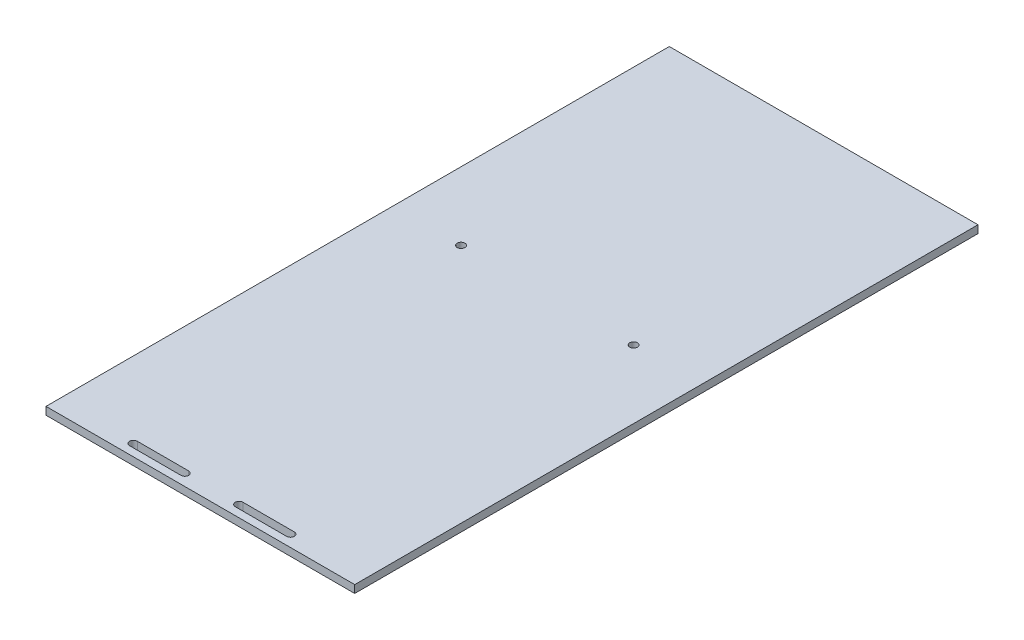
ISO-10303-21;
HEADER;
FILE_DESCRIPTION(('STEP AP214'),'2;1');
FILE_NAME('part.step','',(''),(''),'','','');
FILE_SCHEMA(('AUTOMOTIVE_DESIGN { 1 0 10303 214 1 1 1 1 }'));
ENDSEC;
DATA;
#1=APPLICATION_CONTEXT('core data for automotive mechanical design processes');
#2=APPLICATION_PROTOCOL_DEFINITION('international standard','automotive_design',2000,#1);
#3=PRODUCT_CONTEXT('',#1,'mechanical');
#4=PRODUCT('Part','Part','',(#3));
#5=PRODUCT_RELATED_PRODUCT_CATEGORY('part','',(#4));
#6=PRODUCT_DEFINITION_FORMATION('','',#4);
#7=PRODUCT_DEFINITION_CONTEXT('part definition',#1,'design');
#8=PRODUCT_DEFINITION('design','',#6,#7);
#9=PRODUCT_DEFINITION_SHAPE('','',#8);
#10=(LENGTH_UNIT() NAMED_UNIT(*) SI_UNIT(.MILLI.,.METRE.));
#11=(NAMED_UNIT(*) PLANE_ANGLE_UNIT() SI_UNIT($,.RADIAN.));
#12=(NAMED_UNIT(*) SI_UNIT($,.STERADIAN.) SOLID_ANGLE_UNIT());
#13=UNCERTAINTY_MEASURE_WITH_UNIT(LENGTH_MEASURE(1.E-05),#10,'distance_accuracy_value','');
#14=(GEOMETRIC_REPRESENTATION_CONTEXT(3) GLOBAL_UNCERTAINTY_ASSIGNED_CONTEXT((#13)) GLOBAL_UNIT_ASSIGNED_CONTEXT((#10,
#11,#12)) REPRESENTATION_CONTEXT('',''));
#15=CARTESIAN_POINT('',(0.,0.,0.));
#16=DIRECTION('',(0.,0.,1.));
#17=DIRECTION('',(1.,0.,0.));
#18=AXIS2_PLACEMENT_3D('',#15,#16,#17);
#19=CARTESIAN_POINT('',(0.,3.,0.));
#20=DIRECTION('',(0.,0.,-1.));
#21=DIRECTION('',(-1.,0.,0.));
#22=AXIS2_PLACEMENT_3D('',#19,#20,#21);
#23=PLANE('',#22);
#24=DIRECTION('',(1.,0.,0.));
#25=VECTOR('',#24,1.);
#26=CARTESIAN_POINT('',(0.,0.,0.));
#27=LINE('',#26,#25);
#28=CARTESIAN_POINT('',(0.,0.,0.));
#29=VERTEX_POINT('',#28);
#30=CARTESIAN_POINT('',(120.112060779303,0.,0.));
#31=VERTEX_POINT('',#30);
#32=EDGE_CURVE('E225',#29,#31,#27,.T.);
#33=ORIENTED_EDGE('',*,*,#32,.F.);
#34=DIRECTION('',(0.,-1.,0.));
#35=VECTOR('',#34,1.);
#36=CARTESIAN_POINT('',(0.,3.,0.));
#37=LINE('',#36,#35);
#38=CARTESIAN_POINT('',(0.,3.,0.));
#39=VERTEX_POINT('',#38);
#40=EDGE_CURVE('E11',#39,#29,#37,.T.);
#41=ORIENTED_EDGE('',*,*,#40,.F.);
#42=DIRECTION('',(1.,0.,0.));
#43=VECTOR('',#42,1.);
#44=CARTESIAN_POINT('',(0.,3.,0.));
#45=LINE('',#44,#43);
#46=CARTESIAN_POINT('',(120.112060779303,3.,0.));
#47=VERTEX_POINT('',#46);
#48=EDGE_CURVE('E234',#39,#47,#45,.T.);
#49=ORIENTED_EDGE('',*,*,#48,.T.);
#50=DIRECTION('',(0.,-1.,0.));
#51=VECTOR('',#50,1.);
#52=CARTESIAN_POINT('',(120.112060779303,3.,0.));
#53=LINE('',#52,#51);
#54=EDGE_CURVE('E41',#47,#31,#53,.T.);
#55=ORIENTED_EDGE('',*,*,#54,.T.);
#56=EDGE_LOOP('',(#33,#41,#49,#55));
#57=FACE_BOUND('',#56,.T.);
#58=ADVANCED_FACE('F38',(#57),#23,.T.);
#59=CARTESIAN_POINT('',(0.,3.,0.));
#60=DIRECTION('',(1.,0.,0.));
#61=DIRECTION('',(0.,0.,-1.));
#62=AXIS2_PLACEMENT_3D('',#59,#60,#61);
#63=PLANE('',#62);
#64=DIRECTION('',(0.,0.,1.));
#65=VECTOR('',#64,1.);
#66=CARTESIAN_POINT('',(0.,0.,0.));
#67=LINE('',#66,#65);
#68=CARTESIAN_POINT('',(0.,0.,242.505963566266));
#69=VERTEX_POINT('',#68);
#70=EDGE_CURVE('E239',#29,#69,#67,.T.);
#71=ORIENTED_EDGE('',*,*,#70,.T.);
#72=DIRECTION('',(0.,-1.,0.));
#73=VECTOR('',#72,1.);
#74=CARTESIAN_POINT('',(0.,3.,242.505963566266));
#75=LINE('',#74,#73);
#76=CARTESIAN_POINT('',(0.,3.,242.505963566266));
#77=VERTEX_POINT('',#76);
#78=EDGE_CURVE('E47',#77,#69,#75,.T.);
#79=ORIENTED_EDGE('',*,*,#78,.F.);
#80=DIRECTION('',(0.,0.,1.));
#81=VECTOR('',#80,1.);
#82=CARTESIAN_POINT('',(0.,3.,0.));
#83=LINE('',#82,#81);
#84=EDGE_CURVE('E246',#39,#77,#83,.T.);
#85=ORIENTED_EDGE('',*,*,#84,.F.);
#86=ORIENTED_EDGE('',*,*,#40,.T.);
#87=EDGE_LOOP('',(#71,#79,#85,#86));
#88=FACE_BOUND('',#87,.T.);
#89=ADVANCED_FACE('F280',(#88),#63,.F.);
#90=CARTESIAN_POINT('',(0.,3.,242.505963566266));
#91=DIRECTION('',(0.,0.,-1.));
#92=DIRECTION('',(-1.,0.,0.));
#93=AXIS2_PLACEMENT_3D('',#90,#91,#92);
#94=PLANE('',#93);
#95=DIRECTION('',(1.,0.,0.));
#96=VECTOR('',#95,1.);
#97=CARTESIAN_POINT('',(0.,0.,242.505963566266));
#98=LINE('',#97,#96);
#99=CARTESIAN_POINT('',(120.112060779303,0.,242.505963566266));
#100=VERTEX_POINT('',#99);
#101=EDGE_CURVE('E256',#69,#100,#98,.T.);
#102=ORIENTED_EDGE('',*,*,#101,.T.);
#103=DIRECTION('',(0.,-1.,0.));
#104=VECTOR('',#103,1.);
#105=CARTESIAN_POINT('',(120.112060779303,3.,242.505963566266));
#106=LINE('',#105,#104);
#107=CARTESIAN_POINT('',(120.112060779303,3.,242.505963566266));
#108=VERTEX_POINT('',#107);
#109=EDGE_CURVE('E264',#108,#100,#106,.T.);
#110=ORIENTED_EDGE('',*,*,#109,.F.);
#111=DIRECTION('',(1.,0.,0.));
#112=VECTOR('',#111,1.);
#113=CARTESIAN_POINT('',(0.,3.,242.505963566266));
#114=LINE('',#113,#112);
#115=EDGE_CURVE('E243',#77,#108,#114,.T.);
#116=ORIENTED_EDGE('',*,*,#115,.F.);
#117=ORIENTED_EDGE('',*,*,#78,.T.);
#118=EDGE_LOOP('',(#102,#110,#116,#117));
#119=FACE_BOUND('',#118,.T.);
#120=ADVANCED_FACE('F284',(#119),#94,.F.);
#121=CARTESIAN_POINT('',(120.112060779303,3.,0.));
#122=DIRECTION('',(1.,0.,0.));
#123=DIRECTION('',(0.,0.,-1.));
#124=AXIS2_PLACEMENT_3D('',#121,#122,#123);
#125=PLANE('',#124);
#126=DIRECTION('',(0.,0.,1.));
#127=VECTOR('',#126,1.);
#128=CARTESIAN_POINT('',(120.112060779303,0.,0.));
#129=LINE('',#128,#127);
#130=EDGE_CURVE('E252',#31,#100,#129,.T.);
#131=ORIENTED_EDGE('',*,*,#130,.F.);
#132=ORIENTED_EDGE('',*,*,#54,.F.);
#133=DIRECTION('',(0.,0.,1.));
#134=VECTOR('',#133,1.);
#135=CARTESIAN_POINT('',(120.112060779303,3.,0.));
#136=LINE('',#135,#134);
#137=EDGE_CURVE('E238',#47,#108,#136,.T.);
#138=ORIENTED_EDGE('',*,*,#137,.T.);
#139=ORIENTED_EDGE('',*,*,#109,.T.);
#140=EDGE_LOOP('',(#131,#132,#138,#139));
#141=FACE_BOUND('',#140,.T.);
#142=ADVANCED_FACE('F274',(#141),#125,.T.);
#143=CARTESIAN_POINT('',(0.,3.,0.));
#144=DIRECTION('',(0.,-1.,0.));
#145=DIRECTION('',(0.,0.,-1.));
#146=AXIS2_PLACEMENT_3D('',#143,#144,#145);
#147=PLANE('',#146);
#148=DIRECTION('',(1.,0.,0.));
#149=VECTOR('',#148,1.);
#150=CARTESIAN_POINT('',(70.6120607793027,3.,239.5));
#151=LINE('',#150,#149);
#152=CARTESIAN_POINT('',(70.6120607793027,3.,239.5));
#153=VERTEX_POINT('',#152);
#154=CARTESIAN_POINT('',(90.6120607793027,3.,239.5));
#155=VERTEX_POINT('',#154);
#156=EDGE_CURVE('E168',#153,#155,#151,.T.);
#157=ORIENTED_EDGE('',*,*,#156,.F.);
#158=CARTESIAN_POINT('',(70.6120607793027,3.,238.));
#159=DIRECTION('',(0.,1.,0.));
#160=DIRECTION('',(0.,0.,1.));
#161=AXIS2_PLACEMENT_3D('',#158,#159,#160);
#162=CIRCLE('',#161,1.5);
#163=CARTESIAN_POINT('',(70.6120607793027,3.,236.5));
#164=VERTEX_POINT('',#163);
#165=EDGE_CURVE('E55',#164,#153,#162,.T.);
#166=ORIENTED_EDGE('',*,*,#165,.F.);
#167=DIRECTION('',(-1.,0.,0.));
#168=VECTOR('',#167,1.);
#169=CARTESIAN_POINT('',(70.6120607793027,3.,236.5));
#170=LINE('',#169,#168);
#171=CARTESIAN_POINT('',(90.6120607793027,3.,236.5));
#172=VERTEX_POINT('',#171);
#173=EDGE_CURVE('E152',#172,#164,#170,.T.);
#174=ORIENTED_EDGE('',*,*,#173,.F.);
#175=CARTESIAN_POINT('',(90.6120607793027,3.,238.));
#176=DIRECTION('',(0.,1.,0.));
#177=DIRECTION('',(0.,0.,1.));
#178=AXIS2_PLACEMENT_3D('',#175,#176,#177);
#179=CIRCLE('',#178,1.5);
#180=EDGE_CURVE('E156',#155,#172,#179,.T.);
#181=ORIENTED_EDGE('',*,*,#180,.F.);
#182=EDGE_LOOP('',(#157,#166,#174,#181));
#183=FACE_BOUND('',#182,.T.);
#184=CARTESIAN_POINT('',(26.5,3.,107.505963566266));
#185=DIRECTION('',(0.,1.,0.));
#186=DIRECTION('',(0.,0.,1.));
#187=AXIS2_PLACEMENT_3D('',#184,#185,#186);
#188=CIRCLE('',#187,1.5);
#189=CARTESIAN_POINT('',(26.5,3.,109.005963566266));
#190=VERTEX_POINT('',#189);
#191=EDGE_CURVE('E186',#190,#190,#188,.T.);
#192=ORIENTED_EDGE('',*,*,#191,.F.);
#193=EDGE_LOOP('',(#192));
#194=FACE_BOUND('',#193,.T.);
#195=CARTESIAN_POINT('',(93.6120607793027,3.,107.505963566266));
#196=DIRECTION('',(0.,1.,0.));
#197=DIRECTION('',(0.,0.,1.));
#198=AXIS2_PLACEMENT_3D('',#195,#196,#197);
#199=CIRCLE('',#198,1.5);
#200=CARTESIAN_POINT('',(93.6120607793027,3.,109.005963566266));
#201=VERTEX_POINT('',#200);
#202=EDGE_CURVE('E159',#201,#201,#199,.T.);
#203=ORIENTED_EDGE('',*,*,#202,.F.);
#204=EDGE_LOOP('',(#203));
#205=FACE_BOUND('',#204,.T.);
#206=DIRECTION('',(1.,0.,0.));
#207=VECTOR('',#206,1.);
#208=CARTESIAN_POINT('',(29.5,3.,239.5));
#209=LINE('',#208,#207);
#210=CARTESIAN_POINT('',(29.5,3.,239.5));
#211=VERTEX_POINT('',#210);
#212=CARTESIAN_POINT('',(49.5,3.,239.5));
#213=VERTEX_POINT('',#212);
#214=EDGE_CURVE('E211',#211,#213,#209,.T.);
#215=ORIENTED_EDGE('',*,*,#214,.F.);
#216=CARTESIAN_POINT('',(29.5,3.,238.));
#217=DIRECTION('',(0.,1.,0.));
#218=DIRECTION('',(0.,0.,1.));
#219=AXIS2_PLACEMENT_3D('',#216,#217,#218);
#220=CIRCLE('',#219,1.5);
#221=CARTESIAN_POINT('',(29.5,3.,236.5));
#222=VERTEX_POINT('',#221);
#223=EDGE_CURVE('E63',#222,#211,#220,.T.);
#224=ORIENTED_EDGE('',*,*,#223,.F.);
#225=DIRECTION('',(-1.,0.,0.));
#226=VECTOR('',#225,1.);
#227=CARTESIAN_POINT('',(29.5,3.,236.5));
#228=LINE('',#227,#226);
#229=CARTESIAN_POINT('',(49.5,3.,236.5));
#230=VERTEX_POINT('',#229);
#231=EDGE_CURVE('E196',#230,#222,#228,.T.);
#232=ORIENTED_EDGE('',*,*,#231,.F.);
#233=CARTESIAN_POINT('',(49.5,3.,238.));
#234=DIRECTION('',(0.,1.,0.));
#235=DIRECTION('',(0.,0.,1.));
#236=AXIS2_PLACEMENT_3D('',#233,#234,#235);
#237=CIRCLE('',#236,1.5);
#238=EDGE_CURVE('E215',#213,#230,#237,.T.);
#239=ORIENTED_EDGE('',*,*,#238,.F.);
#240=EDGE_LOOP('',(#215,#224,#232,#239));
#241=FACE_BOUND('',#240,.T.);
#242=ORIENTED_EDGE('',*,*,#48,.F.);
#243=ORIENTED_EDGE('',*,*,#84,.T.);
#244=ORIENTED_EDGE('',*,*,#115,.T.);
#245=ORIENTED_EDGE('',*,*,#137,.F.);
#246=EDGE_LOOP('',(#242,#243,#244,#245));
#247=FACE_BOUND('',#246,.T.);
#248=ADVANCED_FACE('F286',(#183,#194,#205,#241,#247),#147,.F.);
#249=CARTESIAN_POINT('',(0.,0.,0.));
#250=DIRECTION('',(0.,-1.,0.));
#251=DIRECTION('',(0.,0.,-1.));
#252=AXIS2_PLACEMENT_3D('',#249,#250,#251);
#253=PLANE('',#252);
#254=CARTESIAN_POINT('',(70.6120607793027,0.,238.));
#255=DIRECTION('',(0.,1.,0.));
#256=DIRECTION('',(0.,0.,1.));
#257=AXIS2_PLACEMENT_3D('',#254,#255,#256);
#258=CIRCLE('',#257,1.5);
#259=CARTESIAN_POINT('',(70.6120607793027,0.,236.5));
#260=VERTEX_POINT('',#259);
#261=CARTESIAN_POINT('',(70.6120607793027,0.,239.5));
#262=VERTEX_POINT('',#261);
#263=EDGE_CURVE('E130',#260,#262,#258,.T.);
#264=ORIENTED_EDGE('',*,*,#263,.T.);
#265=DIRECTION('',(1.,0.,0.));
#266=VECTOR('',#265,1.);
#267=CARTESIAN_POINT('',(70.6120607793027,0.,239.5));
#268=LINE('',#267,#266);
#269=CARTESIAN_POINT('',(90.6120607793027,0.,239.5));
#270=VERTEX_POINT('',#269);
#271=EDGE_CURVE('E141',#262,#270,#268,.T.);
#272=ORIENTED_EDGE('',*,*,#271,.T.);
#273=CARTESIAN_POINT('',(90.6120607793027,0.,238.));
#274=DIRECTION('',(0.,1.,0.));
#275=DIRECTION('',(0.,0.,1.));
#276=AXIS2_PLACEMENT_3D('',#273,#274,#275);
#277=CIRCLE('',#276,1.5);
#278=CARTESIAN_POINT('',(90.6120607793027,0.,236.5));
#279=VERTEX_POINT('',#278);
#280=EDGE_CURVE('E146',#270,#279,#277,.T.);
#281=ORIENTED_EDGE('',*,*,#280,.T.);
#282=DIRECTION('',(-1.,0.,0.));
#283=VECTOR('',#282,1.);
#284=CARTESIAN_POINT('',(70.6120607793027,0.,236.5));
#285=LINE('',#284,#283);
#286=EDGE_CURVE('E137',#279,#260,#285,.T.);
#287=ORIENTED_EDGE('',*,*,#286,.T.);
#288=EDGE_LOOP('',(#264,#272,#281,#287));
#289=FACE_BOUND('',#288,.T.);
#290=CARTESIAN_POINT('',(26.5,0.,107.505963566266));
#291=DIRECTION('',(0.,1.,0.));
#292=DIRECTION('',(0.,0.,1.));
#293=AXIS2_PLACEMENT_3D('',#290,#291,#292);
#294=CIRCLE('',#293,1.5);
#295=CARTESIAN_POINT('',(26.5,0.,109.005963566266));
#296=VERTEX_POINT('',#295);
#297=EDGE_CURVE('E169',#296,#296,#294,.T.);
#298=ORIENTED_EDGE('',*,*,#297,.T.);
#299=EDGE_LOOP('',(#298));
#300=FACE_BOUND('',#299,.T.);
#301=CARTESIAN_POINT('',(93.6120607793027,0.,107.505963566266));
#302=DIRECTION('',(0.,1.,0.));
#303=DIRECTION('',(0.,0.,1.));
#304=AXIS2_PLACEMENT_3D('',#301,#302,#303);
#305=CIRCLE('',#304,1.5);
#306=CARTESIAN_POINT('',(93.6120607793027,0.,109.005963566266));
#307=VERTEX_POINT('',#306);
#308=EDGE_CURVE('E190',#307,#307,#305,.T.);
#309=ORIENTED_EDGE('',*,*,#308,.T.);
#310=EDGE_LOOP('',(#309));
#311=FACE_BOUND('',#310,.T.);
#312=CARTESIAN_POINT('',(29.5,0.,238.));
#313=DIRECTION('',(0.,1.,0.));
#314=DIRECTION('',(0.,0.,1.));
#315=AXIS2_PLACEMENT_3D('',#312,#313,#314);
#316=CIRCLE('',#315,1.5);
#317=CARTESIAN_POINT('',(29.5,0.,236.5));
#318=VERTEX_POINT('',#317);
#319=CARTESIAN_POINT('',(29.5,0.,239.5));
#320=VERTEX_POINT('',#319);
#321=EDGE_CURVE('E191',#318,#320,#316,.T.);
#322=ORIENTED_EDGE('',*,*,#321,.T.);
#323=DIRECTION('',(1.,0.,0.));
#324=VECTOR('',#323,1.);
#325=CARTESIAN_POINT('',(29.5,0.,239.5));
#326=LINE('',#325,#324);
#327=CARTESIAN_POINT('',(49.5,0.,239.5));
#328=VERTEX_POINT('',#327);
#329=EDGE_CURVE('E195',#320,#328,#326,.T.);
#330=ORIENTED_EDGE('',*,*,#329,.T.);
#331=CARTESIAN_POINT('',(49.5,0.,238.));
#332=DIRECTION('',(0.,1.,0.));
#333=DIRECTION('',(0.,0.,1.));
#334=AXIS2_PLACEMENT_3D('',#331,#332,#333);
#335=CIRCLE('',#334,1.5);
#336=CARTESIAN_POINT('',(49.5,0.,236.5));
#337=VERTEX_POINT('',#336);
#338=EDGE_CURVE('E200',#328,#337,#335,.T.);
#339=ORIENTED_EDGE('',*,*,#338,.T.);
#340=DIRECTION('',(-1.,0.,0.));
#341=VECTOR('',#340,1.);
#342=CARTESIAN_POINT('',(29.5,0.,236.5));
#343=LINE('',#342,#341);
#344=EDGE_CURVE('E204',#337,#318,#343,.T.);
#345=ORIENTED_EDGE('',*,*,#344,.T.);
#346=EDGE_LOOP('',(#322,#330,#339,#345));
#347=FACE_BOUND('',#346,.T.);
#348=ORIENTED_EDGE('',*,*,#32,.T.);
#349=ORIENTED_EDGE('',*,*,#130,.T.);
#350=ORIENTED_EDGE('',*,*,#101,.F.);
#351=ORIENTED_EDGE('',*,*,#70,.F.);
#352=EDGE_LOOP('',(#348,#349,#350,#351));
#353=FACE_BOUND('',#352,.T.);
#354=ADVANCED_FACE('F148',(#289,#300,#311,#347,#353),#253,.T.);
#355=CARTESIAN_POINT('',(29.5,0.,238.));
#356=DIRECTION('',(0.,1.,0.));
#357=DIRECTION('',(0.,0.,1.));
#358=AXIS2_PLACEMENT_3D('',#355,#356,#357);
#359=CYLINDRICAL_SURFACE('',#358,1.5);
#360=ORIENTED_EDGE('',*,*,#223,.T.);
#361=DIRECTION('',(0.,1.,0.));
#362=VECTOR('',#361,1.);
#363=CARTESIAN_POINT('',(29.5,0.,239.5));
#364=LINE('',#363,#362);
#365=EDGE_CURVE('E208',#320,#211,#364,.T.);
#366=ORIENTED_EDGE('',*,*,#365,.F.);
#367=ORIENTED_EDGE('',*,*,#321,.F.);
#368=DIRECTION('',(0.,1.,0.));
#369=VECTOR('',#368,1.);
#370=CARTESIAN_POINT('',(29.5,0.,236.5));
#371=LINE('',#370,#369);
#372=EDGE_CURVE('E222',#318,#222,#371,.T.);
#373=ORIENTED_EDGE('',*,*,#372,.T.);
#374=EDGE_LOOP('',(#360,#366,#367,#373));
#375=FACE_BOUND('',#374,.T.);
#376=ADVANCED_FACE('F294',(#375),#359,.F.);
#377=CARTESIAN_POINT('',(29.5,0.,236.5));
#378=DIRECTION('',(0.,0.,-1.));
#379=DIRECTION('',(-1.,0.,0.));
#380=AXIS2_PLACEMENT_3D('',#377,#378,#379);
#381=PLANE('',#380);
#382=ORIENTED_EDGE('',*,*,#231,.T.);
#383=ORIENTED_EDGE('',*,*,#372,.F.);
#384=ORIENTED_EDGE('',*,*,#344,.F.);
#385=DIRECTION('',(0.,1.,0.));
#386=VECTOR('',#385,1.);
#387=CARTESIAN_POINT('',(49.5,0.,236.5));
#388=LINE('',#387,#386);
#389=EDGE_CURVE('E226',#337,#230,#388,.T.);
#390=ORIENTED_EDGE('',*,*,#389,.T.);
#391=EDGE_LOOP('',(#382,#383,#384,#390));
#392=FACE_BOUND('',#391,.T.);
#393=ADVANCED_FACE('F332',(#392),#381,.F.);
#394=CARTESIAN_POINT('',(49.5,0.,238.));
#395=DIRECTION('',(0.,1.,0.));
#396=DIRECTION('',(0.,0.,1.));
#397=AXIS2_PLACEMENT_3D('',#394,#395,#396);
#398=CYLINDRICAL_SURFACE('',#397,1.5);
#399=ORIENTED_EDGE('',*,*,#238,.T.);
#400=ORIENTED_EDGE('',*,*,#389,.F.);
#401=ORIENTED_EDGE('',*,*,#338,.F.);
#402=DIRECTION('',(0.,1.,0.));
#403=VECTOR('',#402,1.);
#404=CARTESIAN_POINT('',(49.5,0.,239.5));
#405=LINE('',#404,#403);
#406=EDGE_CURVE('E229',#328,#213,#405,.T.);
#407=ORIENTED_EDGE('',*,*,#406,.T.);
#408=EDGE_LOOP('',(#399,#400,#401,#407));
#409=FACE_BOUND('',#408,.T.);
#410=ADVANCED_FACE('F340',(#409),#398,.F.);
#411=CARTESIAN_POINT('',(29.5,0.,239.5));
#412=DIRECTION('',(0.,0.,1.));
#413=DIRECTION('',(1.,0.,0.));
#414=AXIS2_PLACEMENT_3D('',#411,#412,#413);
#415=PLANE('',#414);
#416=ORIENTED_EDGE('',*,*,#214,.T.);
#417=ORIENTED_EDGE('',*,*,#406,.F.);
#418=ORIENTED_EDGE('',*,*,#329,.F.);
#419=ORIENTED_EDGE('',*,*,#365,.T.);
#420=EDGE_LOOP('',(#416,#417,#418,#419));
#421=FACE_BOUND('',#420,.T.);
#422=ADVANCED_FACE('F350',(#421),#415,.F.);
#423=CARTESIAN_POINT('',(93.6120607793027,0.,107.505963566266));
#424=DIRECTION('',(0.,1.,0.));
#425=DIRECTION('',(0.,0.,1.));
#426=AXIS2_PLACEMENT_3D('',#423,#424,#425);
#427=CYLINDRICAL_SURFACE('',#426,1.5);
#428=ORIENTED_EDGE('',*,*,#308,.F.);
#429=EDGE_LOOP('',(#428));
#430=FACE_BOUND('',#429,.T.);
#431=ORIENTED_EDGE('',*,*,#202,.T.);
#432=EDGE_LOOP('',(#431));
#433=FACE_BOUND('',#432,.T.);
#434=ADVANCED_FACE('F360',(#430,#433),#427,.F.);
#435=CARTESIAN_POINT('',(26.5,0.,107.505963566266));
#436=DIRECTION('',(0.,1.,0.));
#437=DIRECTION('',(0.,0.,1.));
#438=AXIS2_PLACEMENT_3D('',#435,#436,#437);
#439=CYLINDRICAL_SURFACE('',#438,1.5);
#440=ORIENTED_EDGE('',*,*,#297,.F.);
#441=EDGE_LOOP('',(#440));
#442=FACE_BOUND('',#441,.T.);
#443=ORIENTED_EDGE('',*,*,#191,.T.);
#444=EDGE_LOOP('',(#443));
#445=FACE_BOUND('',#444,.T.);
#446=ADVANCED_FACE('F370',(#442,#445),#439,.F.);
#447=CARTESIAN_POINT('',(70.6120607793027,0.,238.));
#448=DIRECTION('',(0.,1.,0.));
#449=DIRECTION('',(0.,0.,1.));
#450=AXIS2_PLACEMENT_3D('',#447,#448,#449);
#451=CYLINDRICAL_SURFACE('',#450,1.5);
#452=ORIENTED_EDGE('',*,*,#165,.T.);
#453=DIRECTION('',(0.,1.,0.));
#454=VECTOR('',#453,1.);
#455=CARTESIAN_POINT('',(70.6120607793027,0.,239.5));
#456=LINE('',#455,#454);
#457=EDGE_CURVE('E126',#262,#153,#456,.T.);
#458=ORIENTED_EDGE('',*,*,#457,.F.);
#459=ORIENTED_EDGE('',*,*,#263,.F.);
#460=DIRECTION('',(0.,1.,0.));
#461=VECTOR('',#460,1.);
#462=CARTESIAN_POINT('',(70.6120607793027,0.,236.5));
#463=LINE('',#462,#461);
#464=EDGE_CURVE('E175',#260,#164,#463,.T.);
#465=ORIENTED_EDGE('',*,*,#464,.T.);
#466=EDGE_LOOP('',(#452,#458,#459,#465));
#467=FACE_BOUND('',#466,.T.);
#468=ADVANCED_FACE('F128',(#467),#451,.F.);
#469=CARTESIAN_POINT('',(70.6120607793027,0.,236.5));
#470=DIRECTION('',(0.,0.,-1.));
#471=DIRECTION('',(-1.,0.,0.));
#472=AXIS2_PLACEMENT_3D('',#469,#470,#471);
#473=PLANE('',#472);
#474=ORIENTED_EDGE('',*,*,#173,.T.);
#475=ORIENTED_EDGE('',*,*,#464,.F.);
#476=ORIENTED_EDGE('',*,*,#286,.F.);
#477=DIRECTION('',(0.,1.,0.));
#478=VECTOR('',#477,1.);
#479=CARTESIAN_POINT('',(90.6120607793027,0.,236.5));
#480=LINE('',#479,#478);
#481=EDGE_CURVE('E178',#279,#172,#480,.T.);
#482=ORIENTED_EDGE('',*,*,#481,.T.);
#483=EDGE_LOOP('',(#474,#475,#476,#482));
#484=FACE_BOUND('',#483,.T.);
#485=ADVANCED_FACE('F389',(#484),#473,.F.);
#486=CARTESIAN_POINT('',(90.6120607793027,0.,238.));
#487=DIRECTION('',(0.,1.,0.));
#488=DIRECTION('',(0.,0.,1.));
#489=AXIS2_PLACEMENT_3D('',#486,#487,#488);
#490=CYLINDRICAL_SURFACE('',#489,1.5);
#491=ORIENTED_EDGE('',*,*,#180,.T.);
#492=ORIENTED_EDGE('',*,*,#481,.F.);
#493=ORIENTED_EDGE('',*,*,#280,.F.);
#494=DIRECTION('',(0.,1.,0.));
#495=VECTOR('',#494,1.);
#496=CARTESIAN_POINT('',(90.6120607793027,0.,239.5));
#497=LINE('',#496,#495);
#498=EDGE_CURVE('E136',#270,#155,#497,.T.);
#499=ORIENTED_EDGE('',*,*,#498,.T.);
#500=EDGE_LOOP('',(#491,#492,#493,#499));
#501=FACE_BOUND('',#500,.T.);
#502=ADVANCED_FACE('F398',(#501),#490,.F.);
#503=CARTESIAN_POINT('',(70.6120607793027,0.,239.5));
#504=DIRECTION('',(0.,0.,1.));
#505=DIRECTION('',(1.,0.,0.));
#506=AXIS2_PLACEMENT_3D('',#503,#504,#505);
#507=PLANE('',#506);
#508=ORIENTED_EDGE('',*,*,#156,.T.);
#509=ORIENTED_EDGE('',*,*,#498,.F.);
#510=ORIENTED_EDGE('',*,*,#271,.F.);
#511=ORIENTED_EDGE('',*,*,#457,.T.);
#512=EDGE_LOOP('',(#508,#509,#510,#511));
#513=FACE_BOUND('',#512,.T.);
#514=ADVANCED_FACE('F142',(#513),#507,.F.);
#515=CLOSED_SHELL('',(#58,#89,#120,#142,#248,#354,#376,#393,#410,#422,#434,#446,#468,#485,#502,#514));
#516=MANIFOLD_SOLID_BREP('B2',#515);
#517=ADVANCED_BREP_SHAPE_REPRESENTATION('',(#18,#516),#14);
#518=SHAPE_DEFINITION_REPRESENTATION(#9,#517);
ENDSEC;
END-ISO-10303-21;
